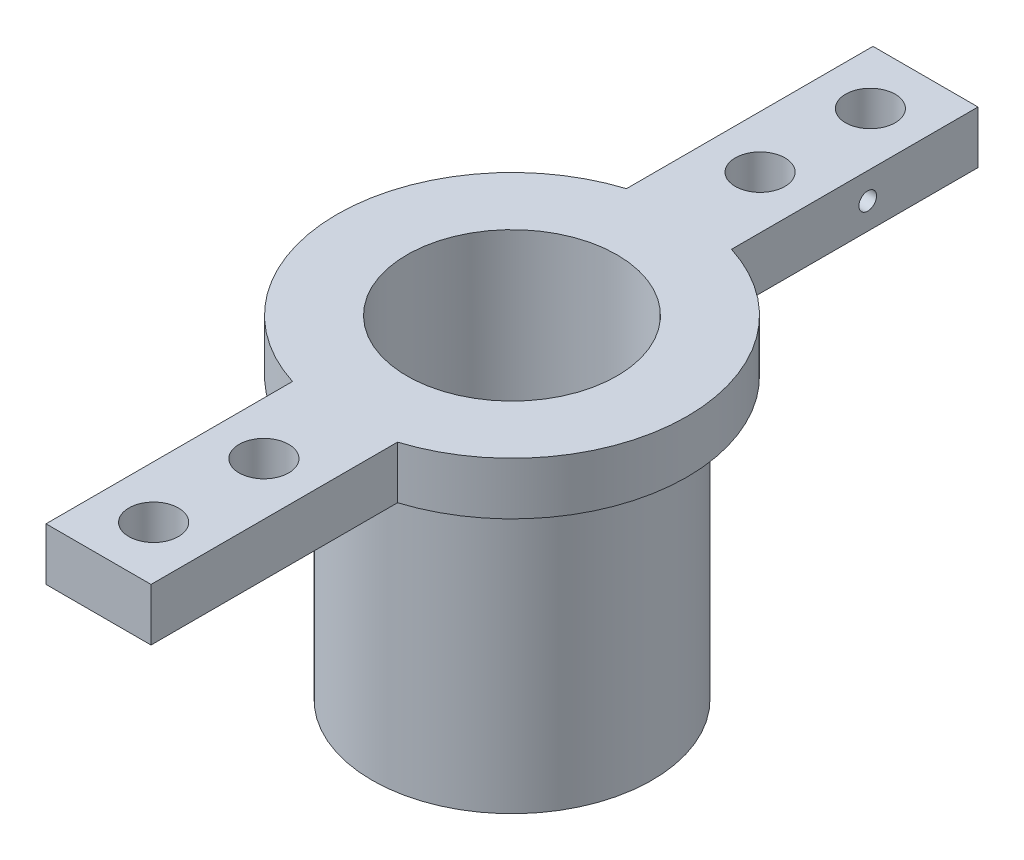
ISO-10303-21;
HEADER;
FILE_DESCRIPTION(('STEP AP214'),'2;1');
FILE_NAME('part.step','',(''),(''),'','','');
FILE_SCHEMA(('AUTOMOTIVE_DESIGN { 1 0 10303 214 1 1 1 1 }'));
ENDSEC;
DATA;
#1=APPLICATION_CONTEXT('core data for automotive mechanical design processes');
#2=APPLICATION_PROTOCOL_DEFINITION('international standard','automotive_design',2000,#1);
#3=PRODUCT_CONTEXT('',#1,'mechanical');
#4=PRODUCT('Part','Part','',(#3));
#5=PRODUCT_RELATED_PRODUCT_CATEGORY('part','',(#4));
#6=PRODUCT_DEFINITION_FORMATION('','',#4);
#7=PRODUCT_DEFINITION_CONTEXT('part definition',#1,'design');
#8=PRODUCT_DEFINITION('design','',#6,#7);
#9=PRODUCT_DEFINITION_SHAPE('','',#8);
#10=(LENGTH_UNIT() NAMED_UNIT(*) SI_UNIT(.MILLI.,.METRE.));
#11=(NAMED_UNIT(*) PLANE_ANGLE_UNIT() SI_UNIT($,.RADIAN.));
#12=(NAMED_UNIT(*) SI_UNIT($,.STERADIAN.) SOLID_ANGLE_UNIT());
#13=UNCERTAINTY_MEASURE_WITH_UNIT(LENGTH_MEASURE(1.E-05),#10,'distance_accuracy_value','');
#14=(GEOMETRIC_REPRESENTATION_CONTEXT(3) GLOBAL_UNCERTAINTY_ASSIGNED_CONTEXT((#13)) GLOBAL_UNIT_ASSIGNED_CONTEXT((#10,
#11,#12)) REPRESENTATION_CONTEXT('',''));
#15=CARTESIAN_POINT('',(0.,0.,0.));
#16=DIRECTION('',(0.,0.,1.));
#17=DIRECTION('',(1.,0.,0.));
#18=AXIS2_PLACEMENT_3D('',#15,#16,#17);
#19=CARTESIAN_POINT('',(0.,-12.7,0.));
#20=DIRECTION('',(0.,1.,0.));
#21=DIRECTION('',(0.,0.,1.));
#22=AXIS2_PLACEMENT_3D('',#19,#20,#21);
#23=PLANE('',#22);
#24=CARTESIAN_POINT('',(0.,-12.7,0.));
#25=DIRECTION('',(0.,1.,0.));
#26=DIRECTION('',(0.,0.,1.));
#27=AXIS2_PLACEMENT_3D('',#24,#25,#26);
#28=CIRCLE('',#27,12.7);
#29=CARTESIAN_POINT('',(0.,-12.7,12.7));
#30=VERTEX_POINT('',#29);
#31=EDGE_CURVE('E82',#30,#30,#28,.T.);
#32=ORIENTED_EDGE('',*,*,#31,.F.);
#33=EDGE_LOOP('',(#32));
#34=FACE_BOUND('',#33,.T.);
#35=CARTESIAN_POINT('',(0.,-12.7,0.));
#36=DIRECTION('',(0.,1.,0.));
#37=DIRECTION('',(0.,0.,1.));
#38=AXIS2_PLACEMENT_3D('',#35,#36,#37);
#39=CIRCLE('',#38,9.525);
#40=CARTESIAN_POINT('',(0.,-12.7,9.525));
#41=VERTEX_POINT('',#40);
#42=EDGE_CURVE('E207',#41,#41,#39,.T.);
#43=ORIENTED_EDGE('',*,*,#42,.T.);
#44=EDGE_LOOP('',(#43));
#45=FACE_BOUND('',#44,.T.);
#46=ADVANCED_FACE('F78',(#34,#45),#23,.F.);
#47=CARTESIAN_POINT('',(0.,12.7,0.));
#48=DIRECTION('',(0.,-1.,0.));
#49=DIRECTION('',(0.,0.,-1.));
#50=AXIS2_PLACEMENT_3D('',#47,#48,#49);
#51=CYLINDRICAL_SURFACE('',#50,12.7);
#52=CARTESIAN_POINT('',(0.,12.7,0.));
#53=DIRECTION('',(0.,1.,0.));
#54=DIRECTION('',(0.,0.,1.));
#55=AXIS2_PLACEMENT_3D('',#52,#53,#54);
#56=CIRCLE('',#55,12.7);
#57=CARTESIAN_POINT('',(0.,12.7,12.7));
#58=VERTEX_POINT('',#57);
#59=EDGE_CURVE('E12',#58,#58,#56,.T.);
#60=ORIENTED_EDGE('',*,*,#59,.F.);
#61=EDGE_LOOP('',(#60));
#62=FACE_BOUND('',#61,.T.);
#63=ORIENTED_EDGE('',*,*,#31,.T.);
#64=EDGE_LOOP('',(#63));
#65=FACE_BOUND('',#64,.T.);
#66=ADVANCED_FACE('F80',(#62,#65),#51,.T.);
#67=CARTESIAN_POINT('',(0.,12.7,0.));
#68=DIRECTION('',(0.,-1.,0.));
#69=DIRECTION('',(0.,0.,-1.));
#70=AXIS2_PLACEMENT_3D('',#67,#68,#69);
#71=CYLINDRICAL_SURFACE('',#70,9.525);
#72=ORIENTED_EDGE('',*,*,#42,.F.);
#73=EDGE_LOOP('',(#72));
#74=FACE_BOUND('',#73,.T.);
#75=CARTESIAN_POINT('',(0.,17.4625,0.));
#76=DIRECTION('',(0.,-1.,0.));
#77=DIRECTION('',(0.,0.,-1.));
#78=AXIS2_PLACEMENT_3D('',#75,#76,#77);
#79=CIRCLE('',#78,9.525);
#80=CARTESIAN_POINT('',(0.,17.4625,-9.525));
#81=VERTEX_POINT('',#80);
#82=EDGE_CURVE('E179',#81,#81,#79,.T.);
#83=ORIENTED_EDGE('',*,*,#82,.F.);
#84=EDGE_LOOP('',(#83));
#85=FACE_BOUND('',#84,.T.);
#86=ADVANCED_FACE('F219',(#74,#85),#71,.F.);
#87=CARTESIAN_POINT('',(4.7625,17.4625,0.));
#88=DIRECTION('',(-1.,0.,0.));
#89=DIRECTION('',(0.,0.,1.));
#90=AXIS2_PLACEMENT_3D('',#87,#88,#89);
#91=PLANE('',#90);
#92=CARTESIAN_POINT('',(4.7625,15.08125,-27.5));
#93=DIRECTION('',(1.,0.,0.));
#94=DIRECTION('',(0.,0.,-1.));
#95=AXIS2_PLACEMENT_3D('',#92,#93,#94);
#96=CIRCLE('',#95,0.8);
#97=CARTESIAN_POINT('',(4.7625,15.08125,-28.3));
#98=VERTEX_POINT('',#97);
#99=EDGE_CURVE('E286',#98,#98,#96,.T.);
#100=ORIENTED_EDGE('',*,*,#99,.F.);
#101=EDGE_LOOP('',(#100));
#102=FACE_BOUND('',#101,.T.);
#103=DIRECTION('',(0.,0.,-1.));
#104=VECTOR('',#103,1.);
#105=CARTESIAN_POINT('',(4.7625,12.7,0.));
#106=LINE('',#105,#104);
#107=CARTESIAN_POINT('',(4.7625,12.7,-15.143784822494));
#108=VERTEX_POINT('',#107);
#109=CARTESIAN_POINT('',(4.7625,12.7,-37.5));
#110=VERTEX_POINT('',#109);
#111=EDGE_CURVE('E178',#108,#110,#106,.T.);
#112=ORIENTED_EDGE('',*,*,#111,.T.);
#113=DIRECTION('',(0.,-1.,0.));
#114=VECTOR('',#113,1.);
#115=CARTESIAN_POINT('',(4.7625,17.4625,-37.5));
#116=LINE('',#115,#114);
#117=CARTESIAN_POINT('',(4.7625,17.4625,-37.5));
#118=VERTEX_POINT('',#117);
#119=EDGE_CURVE('E202',#118,#110,#116,.T.);
#120=ORIENTED_EDGE('',*,*,#119,.F.);
#121=DIRECTION('',(0.,0.,-1.));
#122=VECTOR('',#121,1.);
#123=CARTESIAN_POINT('',(4.7625,17.4625,0.));
#124=LINE('',#123,#122);
#125=CARTESIAN_POINT('',(4.7625,17.4625,-15.143784822494));
#126=VERTEX_POINT('',#125);
#127=EDGE_CURVE('E135',#126,#118,#124,.T.);
#128=ORIENTED_EDGE('',*,*,#127,.F.);
#129=DIRECTION('',(0.,-1.,0.));
#130=VECTOR('',#129,1.);
#131=CARTESIAN_POINT('',(4.7625,17.4625,-15.143784822494));
#132=LINE('',#131,#130);
#133=EDGE_CURVE('E205',#126,#108,#132,.T.);
#134=ORIENTED_EDGE('',*,*,#133,.T.);
#135=EDGE_LOOP('',(#112,#120,#128,#134));
#136=FACE_BOUND('',#135,.T.);
#137=ADVANCED_FACE('F224',(#102,#136),#91,.F.);
#138=CARTESIAN_POINT('',(0.,17.4625,-37.5));
#139=DIRECTION('',(0.,0.,1.));
#140=DIRECTION('',(1.,0.,0.));
#141=AXIS2_PLACEMENT_3D('',#138,#139,#140);
#142=PLANE('',#141);
#143=DIRECTION('',(-1.,0.,0.));
#144=VECTOR('',#143,1.);
#145=CARTESIAN_POINT('',(0.,12.7,-37.5));
#146=LINE('',#145,#144);
#147=CARTESIAN_POINT('',(-4.7625,12.7,-37.5));
#148=VERTEX_POINT('',#147);
#149=EDGE_CURVE('E181',#110,#148,#146,.T.);
#150=ORIENTED_EDGE('',*,*,#149,.T.);
#151=DIRECTION('',(0.,-1.,0.));
#152=VECTOR('',#151,1.);
#153=CARTESIAN_POINT('',(-4.7625,17.4625,-37.5));
#154=LINE('',#153,#152);
#155=CARTESIAN_POINT('',(-4.7625,17.4625,-37.5));
#156=VERTEX_POINT('',#155);
#157=EDGE_CURVE('E200',#156,#148,#154,.T.);
#158=ORIENTED_EDGE('',*,*,#157,.F.);
#159=DIRECTION('',(-1.,0.,0.));
#160=VECTOR('',#159,1.);
#161=CARTESIAN_POINT('',(0.,17.4625,-37.5));
#162=LINE('',#161,#160);
#163=EDGE_CURVE('E318',#118,#156,#162,.T.);
#164=ORIENTED_EDGE('',*,*,#163,.F.);
#165=ORIENTED_EDGE('',*,*,#119,.T.);
#166=EDGE_LOOP('',(#150,#158,#164,#165));
#167=FACE_BOUND('',#166,.T.);
#168=ADVANCED_FACE('F234',(#167),#142,.F.);
#169=CARTESIAN_POINT('',(-4.7625,17.4625,0.));
#170=DIRECTION('',(-1.,0.,0.));
#171=DIRECTION('',(0.,0.,1.));
#172=AXIS2_PLACEMENT_3D('',#169,#170,#171);
#173=PLANE('',#172);
#174=CARTESIAN_POINT('',(-4.7625,15.08125,-27.5));
#175=DIRECTION('',(-1.,0.,0.));
#176=DIRECTION('',(0.,0.,1.));
#177=AXIS2_PLACEMENT_3D('',#174,#175,#176);
#178=CIRCLE('',#177,0.799999999999997);
#179=CARTESIAN_POINT('',(-4.7625,15.08125,-26.7));
#180=VERTEX_POINT('',#179);
#181=EDGE_CURVE('E283',#180,#180,#178,.T.);
#182=ORIENTED_EDGE('',*,*,#181,.F.);
#183=EDGE_LOOP('',(#182));
#184=FACE_BOUND('',#183,.T.);
#185=DIRECTION('',(0.,0.,-1.));
#186=VECTOR('',#185,1.);
#187=CARTESIAN_POINT('',(-4.7625,12.7,0.));
#188=LINE('',#187,#186);
#189=CARTESIAN_POINT('',(-4.7625,12.7,-15.143784822494));
#190=VERTEX_POINT('',#189);
#191=EDGE_CURVE('E184',#190,#148,#188,.T.);
#192=ORIENTED_EDGE('',*,*,#191,.F.);
#193=DIRECTION('',(0.,-1.,0.));
#194=VECTOR('',#193,1.);
#195=CARTESIAN_POINT('',(-4.7625,17.4625,-15.143784822494));
#196=LINE('',#195,#194);
#197=CARTESIAN_POINT('',(-4.7625,17.4625,-15.143784822494));
#198=VERTEX_POINT('',#197);
#199=EDGE_CURVE('E198',#198,#190,#196,.T.);
#200=ORIENTED_EDGE('',*,*,#199,.F.);
#201=DIRECTION('',(0.,0.,-1.));
#202=VECTOR('',#201,1.);
#203=CARTESIAN_POINT('',(-4.7625,17.4625,0.));
#204=LINE('',#203,#202);
#205=EDGE_CURVE('E320',#198,#156,#204,.T.);
#206=ORIENTED_EDGE('',*,*,#205,.T.);
#207=ORIENTED_EDGE('',*,*,#157,.T.);
#208=EDGE_LOOP('',(#192,#200,#206,#207));
#209=FACE_BOUND('',#208,.T.);
#210=ADVANCED_FACE('F238',(#184,#209),#173,.T.);
#211=CARTESIAN_POINT('',(0.,17.4625,0.));
#212=DIRECTION('',(0.,-1.,0.));
#213=DIRECTION('',(0.,0.,-1.));
#214=AXIS2_PLACEMENT_3D('',#211,#212,#213);
#215=CYLINDRICAL_SURFACE('',#214,15.875);
#216=CARTESIAN_POINT('',(0.,12.7,0.));
#217=DIRECTION('',(0.,1.,0.));
#218=DIRECTION('',(0.,0.,1.));
#219=AXIS2_PLACEMENT_3D('',#216,#217,#218);
#220=CIRCLE('',#219,15.875);
#221=CARTESIAN_POINT('',(-4.7625,12.7,15.143784822494));
#222=VERTEX_POINT('',#221);
#223=EDGE_CURVE('E187',#190,#222,#220,.T.);
#224=ORIENTED_EDGE('',*,*,#223,.T.);
#225=DIRECTION('',(0.,-1.,0.));
#226=VECTOR('',#225,1.);
#227=CARTESIAN_POINT('',(-4.7625,17.4625,15.143784822494));
#228=LINE('',#227,#226);
#229=CARTESIAN_POINT('',(-4.7625,17.4625,15.143784822494));
#230=VERTEX_POINT('',#229);
#231=EDGE_CURVE('E160',#230,#222,#228,.T.);
#232=ORIENTED_EDGE('',*,*,#231,.F.);
#233=CARTESIAN_POINT('',(0.,17.4625,0.));
#234=DIRECTION('',(0.,1.,0.));
#235=DIRECTION('',(0.,0.,1.));
#236=AXIS2_PLACEMENT_3D('',#233,#234,#235);
#237=CIRCLE('',#236,15.875);
#238=EDGE_CURVE('E166',#198,#230,#237,.T.);
#239=ORIENTED_EDGE('',*,*,#238,.F.);
#240=ORIENTED_EDGE('',*,*,#199,.T.);
#241=EDGE_LOOP('',(#224,#232,#239,#240));
#242=FACE_BOUND('',#241,.T.);
#243=ADVANCED_FACE('F242',(#242),#215,.T.);
#244=CARTESIAN_POINT('',(-4.7625,17.4625,0.));
#245=DIRECTION('',(-1.,0.,0.));
#246=DIRECTION('',(0.,0.,1.));
#247=AXIS2_PLACEMENT_3D('',#244,#245,#246);
#248=PLANE('',#247);
#249=DIRECTION('',(0.,0.,-1.));
#250=VECTOR('',#249,1.);
#251=CARTESIAN_POINT('',(-4.7625,12.7,0.));
#252=LINE('',#251,#250);
#253=CARTESIAN_POINT('',(-4.7625,12.7,37.5));
#254=VERTEX_POINT('',#253);
#255=EDGE_CURVE('E155',#254,#222,#252,.T.);
#256=ORIENTED_EDGE('',*,*,#255,.F.);
#257=DIRECTION('',(0.,-1.,0.));
#258=VECTOR('',#257,1.);
#259=CARTESIAN_POINT('',(-4.7625,17.4625,37.5));
#260=LINE('',#259,#258);
#261=CARTESIAN_POINT('',(-4.7625,17.4625,37.5));
#262=VERTEX_POINT('',#261);
#263=EDGE_CURVE('E150',#262,#254,#260,.T.);
#264=ORIENTED_EDGE('',*,*,#263,.F.);
#265=DIRECTION('',(0.,0.,-1.));
#266=VECTOR('',#265,1.);
#267=CARTESIAN_POINT('',(-4.7625,17.4625,0.));
#268=LINE('',#267,#266);
#269=EDGE_CURVE('E153',#262,#230,#268,.T.);
#270=ORIENTED_EDGE('',*,*,#269,.T.);
#271=ORIENTED_EDGE('',*,*,#231,.T.);
#272=EDGE_LOOP('',(#256,#264,#270,#271));
#273=FACE_BOUND('',#272,.T.);
#274=ADVANCED_FACE('F152',(#273),#248,.T.);
#275=CARTESIAN_POINT('',(0.,17.4625,37.5));
#276=DIRECTION('',(0.,0.,1.));
#277=DIRECTION('',(1.,0.,0.));
#278=AXIS2_PLACEMENT_3D('',#275,#276,#277);
#279=PLANE('',#278);
#280=DIRECTION('',(-1.,0.,0.));
#281=VECTOR('',#280,1.);
#282=CARTESIAN_POINT('',(0.,12.7,37.5));
#283=LINE('',#282,#281);
#284=CARTESIAN_POINT('',(4.7625,12.7,37.5));
#285=VERTEX_POINT('',#284);
#286=EDGE_CURVE('E191',#285,#254,#283,.T.);
#287=ORIENTED_EDGE('',*,*,#286,.F.);
#288=DIRECTION('',(0.,-1.,0.));
#289=VECTOR('',#288,1.);
#290=CARTESIAN_POINT('',(4.7625,17.4625,37.5));
#291=LINE('',#290,#289);
#292=CARTESIAN_POINT('',(4.7625,17.4625,37.5));
#293=VERTEX_POINT('',#292);
#294=EDGE_CURVE('E123',#293,#285,#291,.T.);
#295=ORIENTED_EDGE('',*,*,#294,.F.);
#296=DIRECTION('',(-1.,0.,0.));
#297=VECTOR('',#296,1.);
#298=CARTESIAN_POINT('',(0.,17.4625,37.5));
#299=LINE('',#298,#297);
#300=EDGE_CURVE('E163',#293,#262,#299,.T.);
#301=ORIENTED_EDGE('',*,*,#300,.T.);
#302=ORIENTED_EDGE('',*,*,#263,.T.);
#303=EDGE_LOOP('',(#287,#295,#301,#302));
#304=FACE_BOUND('',#303,.T.);
#305=ADVANCED_FACE('F169',(#304),#279,.T.);
#306=CARTESIAN_POINT('',(4.7625,17.4625,0.));
#307=DIRECTION('',(-1.,0.,0.));
#308=DIRECTION('',(0.,0.,1.));
#309=AXIS2_PLACEMENT_3D('',#306,#307,#308);
#310=PLANE('',#309);
#311=DIRECTION('',(0.,0.,-1.));
#312=VECTOR('',#311,1.);
#313=CARTESIAN_POINT('',(4.7625,12.7,0.));
#314=LINE('',#313,#312);
#315=CARTESIAN_POINT('',(4.7625,12.7,15.143784822494));
#316=VERTEX_POINT('',#315);
#317=EDGE_CURVE('E126',#285,#316,#314,.T.);
#318=ORIENTED_EDGE('',*,*,#317,.T.);
#319=DIRECTION('',(0.,-1.,0.));
#320=VECTOR('',#319,1.);
#321=CARTESIAN_POINT('',(4.7625,17.4625,15.143784822494));
#322=LINE('',#321,#320);
#323=CARTESIAN_POINT('',(4.7625,17.4625,15.143784822494));
#324=VERTEX_POINT('',#323);
#325=EDGE_CURVE('E171',#324,#316,#322,.T.);
#326=ORIENTED_EDGE('',*,*,#325,.F.);
#327=DIRECTION('',(0.,0.,-1.));
#328=VECTOR('',#327,1.);
#329=CARTESIAN_POINT('',(4.7625,17.4625,0.));
#330=LINE('',#329,#328);
#331=EDGE_CURVE('E95',#293,#324,#330,.T.);
#332=ORIENTED_EDGE('',*,*,#331,.F.);
#333=ORIENTED_EDGE('',*,*,#294,.T.);
#334=EDGE_LOOP('',(#318,#326,#332,#333));
#335=FACE_BOUND('',#334,.T.);
#336=ADVANCED_FACE('F230',(#335),#310,.F.);
#337=CARTESIAN_POINT('',(0.,17.4625,0.));
#338=DIRECTION('',(0.,-1.,0.));
#339=DIRECTION('',(0.,0.,-1.));
#340=AXIS2_PLACEMENT_3D('',#337,#338,#339);
#341=CYLINDRICAL_SURFACE('',#340,15.875);
#342=CARTESIAN_POINT('',(0.,12.7,0.));
#343=DIRECTION('',(0.,1.,0.));
#344=DIRECTION('',(0.,0.,1.));
#345=AXIS2_PLACEMENT_3D('',#342,#343,#344);
#346=CIRCLE('',#345,15.875);
#347=EDGE_CURVE('E175',#316,#108,#346,.T.);
#348=ORIENTED_EDGE('',*,*,#347,.T.);
#349=ORIENTED_EDGE('',*,*,#133,.F.);
#350=CARTESIAN_POINT('',(0.,17.4625,0.));
#351=DIRECTION('',(0.,1.,0.));
#352=DIRECTION('',(0.,0.,1.));
#353=AXIS2_PLACEMENT_3D('',#350,#351,#352);
#354=CIRCLE('',#353,15.875);
#355=EDGE_CURVE('E194',#324,#126,#354,.T.);
#356=ORIENTED_EDGE('',*,*,#355,.F.);
#357=ORIENTED_EDGE('',*,*,#325,.T.);
#358=EDGE_LOOP('',(#348,#349,#356,#357));
#359=FACE_BOUND('',#358,.T.);
#360=ADVANCED_FACE('F226',(#359),#341,.T.);
#361=CARTESIAN_POINT('',(0.,12.7,0.));
#362=DIRECTION('',(0.,1.,0.));
#363=DIRECTION('',(0.,0.,1.));
#364=AXIS2_PLACEMENT_3D('',#361,#362,#363);
#365=PLANE('',#364);
#366=CARTESIAN_POINT('',(0.,12.7,-32.5));
#367=DIRECTION('',(0.,-1.,0.));
#368=DIRECTION('',(0.,0.,-1.));
#369=AXIS2_PLACEMENT_3D('',#366,#367,#368);
#370=CIRCLE('',#369,2.24999999999999);
#371=CARTESIAN_POINT('',(0.,12.7,-34.75));
#372=VERTEX_POINT('',#371);
#373=EDGE_CURVE('E288',#372,#372,#370,.T.);
#374=ORIENTED_EDGE('',*,*,#373,.F.);
#375=EDGE_LOOP('',(#374));
#376=FACE_BOUND('',#375,.T.);
#377=CARTESIAN_POINT('',(0.,12.7,-22.5));
#378=DIRECTION('',(0.,-1.,0.));
#379=DIRECTION('',(0.,0.,-1.));
#380=AXIS2_PLACEMENT_3D('',#377,#378,#379);
#381=CIRCLE('',#380,2.24999999999999);
#382=CARTESIAN_POINT('',(0.,12.7,-24.75));
#383=VERTEX_POINT('',#382);
#384=EDGE_CURVE('E296',#383,#383,#381,.T.);
#385=ORIENTED_EDGE('',*,*,#384,.F.);
#386=EDGE_LOOP('',(#385));
#387=FACE_BOUND('',#386,.T.);
#388=CARTESIAN_POINT('',(0.,12.7,22.5));
#389=DIRECTION('',(0.,-1.,0.));
#390=DIRECTION('',(0.,0.,-1.));
#391=AXIS2_PLACEMENT_3D('',#388,#389,#390);
#392=CIRCLE('',#391,2.24999999999999);
#393=CARTESIAN_POINT('',(0.,12.7,20.25));
#394=VERTEX_POINT('',#393);
#395=EDGE_CURVE('E302',#394,#394,#392,.T.);
#396=ORIENTED_EDGE('',*,*,#395,.F.);
#397=EDGE_LOOP('',(#396));
#398=FACE_BOUND('',#397,.T.);
#399=CARTESIAN_POINT('',(0.,12.7,32.5));
#400=DIRECTION('',(0.,-1.,0.));
#401=DIRECTION('',(0.,0.,-1.));
#402=AXIS2_PLACEMENT_3D('',#399,#400,#401);
#403=CIRCLE('',#402,2.24999999999999);
#404=CARTESIAN_POINT('',(0.,12.7,30.25));
#405=VERTEX_POINT('',#404);
#406=EDGE_CURVE('E308',#405,#405,#403,.T.);
#407=ORIENTED_EDGE('',*,*,#406,.F.);
#408=EDGE_LOOP('',(#407));
#409=FACE_BOUND('',#408,.T.);
#410=ORIENTED_EDGE('',*,*,#59,.T.);
#411=EDGE_LOOP('',(#410));
#412=FACE_BOUND('',#411,.T.);
#413=ORIENTED_EDGE('',*,*,#347,.F.);
#414=ORIENTED_EDGE('',*,*,#317,.F.);
#415=ORIENTED_EDGE('',*,*,#286,.T.);
#416=ORIENTED_EDGE('',*,*,#255,.T.);
#417=ORIENTED_EDGE('',*,*,#223,.F.);
#418=ORIENTED_EDGE('',*,*,#191,.T.);
#419=ORIENTED_EDGE('',*,*,#149,.F.);
#420=ORIENTED_EDGE('',*,*,#111,.F.);
#421=EDGE_LOOP('',(#413,#414,#415,#416,#417,#418,#419,#420));
#422=FACE_BOUND('',#421,.T.);
#423=ADVANCED_FACE('F229',(#376,#387,#398,#409,#412,#422),#365,.F.);
#424=CARTESIAN_POINT('',(0.,17.4625,0.));
#425=DIRECTION('',(0.,1.,0.));
#426=DIRECTION('',(0.,0.,1.));
#427=AXIS2_PLACEMENT_3D('',#424,#425,#426);
#428=PLANE('',#427);
#429=CARTESIAN_POINT('',(0.,17.4625,-32.5));
#430=DIRECTION('',(0.,-1.,0.));
#431=DIRECTION('',(0.,0.,-1.));
#432=AXIS2_PLACEMENT_3D('',#429,#430,#431);
#433=CIRCLE('',#432,2.25);
#434=CARTESIAN_POINT('',(0.,17.4625,-34.75));
#435=VERTEX_POINT('',#434);
#436=EDGE_CURVE('E293',#435,#435,#433,.T.);
#437=ORIENTED_EDGE('',*,*,#436,.T.);
#438=EDGE_LOOP('',(#437));
#439=FACE_BOUND('',#438,.T.);
#440=CARTESIAN_POINT('',(0.,17.4625,-22.5));
#441=DIRECTION('',(0.,-1.,0.));
#442=DIRECTION('',(0.,0.,-1.));
#443=AXIS2_PLACEMENT_3D('',#440,#441,#442);
#444=CIRCLE('',#443,2.25);
#445=CARTESIAN_POINT('',(0.,17.4625,-24.75));
#446=VERTEX_POINT('',#445);
#447=EDGE_CURVE('E299',#446,#446,#444,.T.);
#448=ORIENTED_EDGE('',*,*,#447,.T.);
#449=EDGE_LOOP('',(#448));
#450=FACE_BOUND('',#449,.T.);
#451=CARTESIAN_POINT('',(0.,17.4625,22.5));
#452=DIRECTION('',(0.,-1.,0.));
#453=DIRECTION('',(0.,0.,-1.));
#454=AXIS2_PLACEMENT_3D('',#451,#452,#453);
#455=CIRCLE('',#454,2.25);
#456=CARTESIAN_POINT('',(0.,17.4625,20.25));
#457=VERTEX_POINT('',#456);
#458=EDGE_CURVE('E305',#457,#457,#455,.T.);
#459=ORIENTED_EDGE('',*,*,#458,.T.);
#460=EDGE_LOOP('',(#459));
#461=FACE_BOUND('',#460,.T.);
#462=CARTESIAN_POINT('',(0.,17.4625,32.5));
#463=DIRECTION('',(0.,-1.,0.));
#464=DIRECTION('',(0.,0.,-1.));
#465=AXIS2_PLACEMENT_3D('',#462,#463,#464);
#466=CIRCLE('',#465,2.25);
#467=CARTESIAN_POINT('',(0.,17.4625,30.25));
#468=VERTEX_POINT('',#467);
#469=EDGE_CURVE('E311',#468,#468,#466,.T.);
#470=ORIENTED_EDGE('',*,*,#469,.T.);
#471=EDGE_LOOP('',(#470));
#472=FACE_BOUND('',#471,.T.);
#473=ORIENTED_EDGE('',*,*,#82,.T.);
#474=EDGE_LOOP('',(#473));
#475=FACE_BOUND('',#474,.T.);
#476=ORIENTED_EDGE('',*,*,#355,.T.);
#477=ORIENTED_EDGE('',*,*,#127,.T.);
#478=ORIENTED_EDGE('',*,*,#163,.T.);
#479=ORIENTED_EDGE('',*,*,#205,.F.);
#480=ORIENTED_EDGE('',*,*,#238,.T.);
#481=ORIENTED_EDGE('',*,*,#269,.F.);
#482=ORIENTED_EDGE('',*,*,#300,.F.);
#483=ORIENTED_EDGE('',*,*,#331,.T.);
#484=EDGE_LOOP('',(#476,#477,#478,#479,#480,#481,#482,#483));
#485=FACE_BOUND('',#484,.T.);
#486=ADVANCED_FACE('F162',(#439,#450,#461,#472,#475,#485),#428,.T.);
#487=CARTESIAN_POINT('',(0.,12.7,32.5));
#488=DIRECTION('',(0.,-1.,0.));
#489=DIRECTION('',(0.,0.,-1.));
#490=AXIS2_PLACEMENT_3D('',#487,#488,#489);
#491=CYLINDRICAL_SURFACE('',#490,2.24999999999999);
#492=ORIENTED_EDGE('',*,*,#469,.F.);
#493=EDGE_LOOP('',(#492));
#494=FACE_BOUND('',#493,.T.);
#495=ORIENTED_EDGE('',*,*,#406,.T.);
#496=EDGE_LOOP('',(#495));
#497=FACE_BOUND('',#496,.T.);
#498=ADVANCED_FACE('F258',(#494,#497),#491,.F.);
#499=CARTESIAN_POINT('',(0.,12.7,22.5));
#500=DIRECTION('',(0.,-1.,0.));
#501=DIRECTION('',(0.,0.,-1.));
#502=AXIS2_PLACEMENT_3D('',#499,#500,#501);
#503=CYLINDRICAL_SURFACE('',#502,2.24999999999999);
#504=ORIENTED_EDGE('',*,*,#458,.F.);
#505=EDGE_LOOP('',(#504));
#506=FACE_BOUND('',#505,.T.);
#507=ORIENTED_EDGE('',*,*,#395,.T.);
#508=EDGE_LOOP('',(#507));
#509=FACE_BOUND('',#508,.T.);
#510=ADVANCED_FACE('F262',(#506,#509),#503,.F.);
#511=CARTESIAN_POINT('',(0.,12.7,-22.5));
#512=DIRECTION('',(0.,-1.,0.));
#513=DIRECTION('',(0.,0.,-1.));
#514=AXIS2_PLACEMENT_3D('',#511,#512,#513);
#515=CYLINDRICAL_SURFACE('',#514,2.24999999999999);
#516=ORIENTED_EDGE('',*,*,#447,.F.);
#517=EDGE_LOOP('',(#516));
#518=FACE_BOUND('',#517,.T.);
#519=ORIENTED_EDGE('',*,*,#384,.T.);
#520=EDGE_LOOP('',(#519));
#521=FACE_BOUND('',#520,.T.);
#522=ADVANCED_FACE('F266',(#518,#521),#515,.F.);
#523=CARTESIAN_POINT('',(0.,12.7,-32.5));
#524=DIRECTION('',(0.,-1.,0.));
#525=DIRECTION('',(0.,0.,-1.));
#526=AXIS2_PLACEMENT_3D('',#523,#524,#525);
#527=CYLINDRICAL_SURFACE('',#526,2.24999999999999);
#528=ORIENTED_EDGE('',*,*,#436,.F.);
#529=EDGE_LOOP('',(#528));
#530=FACE_BOUND('',#529,.T.);
#531=ORIENTED_EDGE('',*,*,#373,.T.);
#532=EDGE_LOOP('',(#531));
#533=FACE_BOUND('',#532,.T.);
#534=ADVANCED_FACE('F270',(#530,#533),#527,.F.);
#535=CARTESIAN_POINT('',(4.7625,15.08125,-27.5));
#536=DIRECTION('',(1.,0.,0.));
#537=DIRECTION('',(0.,0.,-1.));
#538=AXIS2_PLACEMENT_3D('',#535,#536,#537);
#539=CYLINDRICAL_SURFACE('',#538,0.799999999999997);
#540=ORIENTED_EDGE('',*,*,#181,.T.);
#541=EDGE_LOOP('',(#540));
#542=FACE_BOUND('',#541,.T.);
#543=ORIENTED_EDGE('',*,*,#99,.T.);
#544=EDGE_LOOP('',(#543));
#545=FACE_BOUND('',#544,.T.);
#546=ADVANCED_FACE('F274',(#542,#545),#539,.F.);
#547=CLOSED_SHELL('',(#46,#66,#86,#137,#168,#210,#243,#274,#305,#336,#360,#423,#486,#498,#510,
#522,#534,#546));
#548=MANIFOLD_SOLID_BREP('B2',#547);
#549=ADVANCED_BREP_SHAPE_REPRESENTATION('',(#18,#548),#14);
#550=SHAPE_DEFINITION_REPRESENTATION(#9,#549);
ENDSEC;
END-ISO-10303-21;
